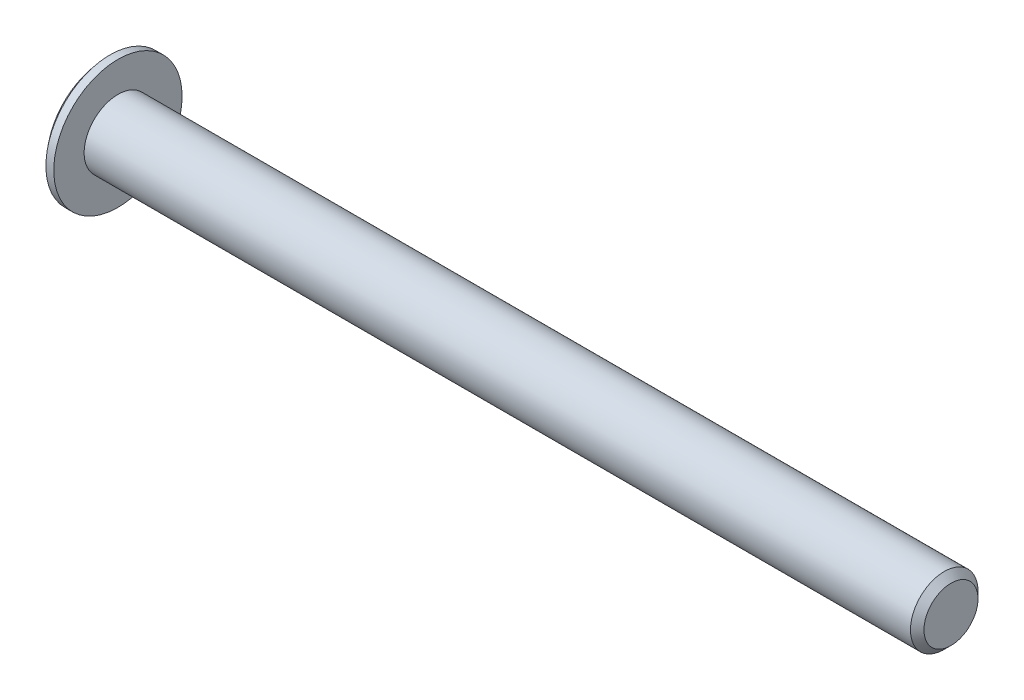
ISO-10303-21;
HEADER;
FILE_DESCRIPTION(('STEP AP214'),'2;1');
FILE_NAME('part.step','',(''),(''),'','','');
FILE_SCHEMA(('AUTOMOTIVE_DESIGN { 1 0 10303 214 1 1 1 1 }'));
ENDSEC;
DATA;
#1=APPLICATION_CONTEXT('core data for automotive mechanical design processes');
#2=APPLICATION_PROTOCOL_DEFINITION('international standard','automotive_design',2000,#1);
#3=PRODUCT_CONTEXT('',#1,'mechanical');
#4=PRODUCT('Part','Part','',(#3));
#5=PRODUCT_RELATED_PRODUCT_CATEGORY('part','',(#4));
#6=PRODUCT_DEFINITION_FORMATION('','',#4);
#7=PRODUCT_DEFINITION_CONTEXT('part definition',#1,'design');
#8=PRODUCT_DEFINITION('design','',#6,#7);
#9=PRODUCT_DEFINITION_SHAPE('','',#8);
#10=(LENGTH_UNIT() NAMED_UNIT(*) SI_UNIT(.MILLI.,.METRE.));
#11=(NAMED_UNIT(*) PLANE_ANGLE_UNIT() SI_UNIT($,.RADIAN.));
#12=(NAMED_UNIT(*) SI_UNIT($,.STERADIAN.) SOLID_ANGLE_UNIT());
#13=UNCERTAINTY_MEASURE_WITH_UNIT(LENGTH_MEASURE(1.E-05),#10,'distance_accuracy_value','');
#14=(GEOMETRIC_REPRESENTATION_CONTEXT(3) GLOBAL_UNCERTAINTY_ASSIGNED_CONTEXT((#13)) GLOBAL_UNIT_ASSIGNED_CONTEXT((#10,
#11,#12)) REPRESENTATION_CONTEXT('',''));
#15=CARTESIAN_POINT('',(0.,0.,0.));
#16=DIRECTION('',(0.,0.,1.));
#17=DIRECTION('',(1.,0.,0.));
#18=AXIS2_PLACEMENT_3D('',#15,#16,#17);
#19=CARTESIAN_POINT('',(0.,0.,0.));
#20=DIRECTION('',(1.,0.,0.));
#21=DIRECTION('',(0.,0.,1.));
#22=AXIS2_PLACEMENT_3D('',#19,#20,#21);
#23=PLANE('',#22);
#24=DIRECTION('',(0.,-0.5,0.866025403784439));
#25=VECTOR('',#24,1.);
#26=CARTESIAN_POINT('',(0.,2.3094010767585,0.));
#27=LINE('',#26,#25);
#28=CARTESIAN_POINT('',(0.,2.3094010767585,0.));
#29=VERTEX_POINT('',#28);
#30=CARTESIAN_POINT('',(0.,1.15470053837925,2.));
#31=VERTEX_POINT('',#30);
#32=EDGE_CURVE('E174',#29,#31,#27,.T.);
#33=ORIENTED_EDGE('',*,*,#32,.T.);
#34=DIRECTION('',(0.,-1.,0.));
#35=VECTOR('',#34,1.);
#36=CARTESIAN_POINT('',(0.,1.15470053837925,2.));
#37=LINE('',#36,#35);
#38=CARTESIAN_POINT('',(0.,-1.15470053837925,2.));
#39=VERTEX_POINT('',#38);
#40=EDGE_CURVE('E181',#31,#39,#37,.T.);
#41=ORIENTED_EDGE('',*,*,#40,.T.);
#42=DIRECTION('',(0.,-0.5,-0.866025403784439));
#43=VECTOR('',#42,1.);
#44=CARTESIAN_POINT('',(0.,-1.15470053837925,2.));
#45=LINE('',#44,#43);
#46=CARTESIAN_POINT('',(0.,-2.3094010767585,0.));
#47=VERTEX_POINT('',#46);
#48=EDGE_CURVE('E186',#39,#47,#45,.T.);
#49=ORIENTED_EDGE('',*,*,#48,.T.);
#50=DIRECTION('',(0.,0.5,-0.866025403784439));
#51=VECTOR('',#50,1.);
#52=CARTESIAN_POINT('',(0.,-2.3094010767585,0.));
#53=LINE('',#52,#51);
#54=CARTESIAN_POINT('',(0.,-1.15470053837925,-2.));
#55=VERTEX_POINT('',#54);
#56=EDGE_CURVE('E119',#47,#55,#53,.T.);
#57=ORIENTED_EDGE('',*,*,#56,.T.);
#58=DIRECTION('',(0.,1.,0.));
#59=VECTOR('',#58,1.);
#60=CARTESIAN_POINT('',(0.,-1.15470053837925,-2.));
#61=LINE('',#60,#59);
#62=CARTESIAN_POINT('',(0.,1.15470053837925,-2.));
#63=VERTEX_POINT('',#62);
#64=EDGE_CURVE('E193',#55,#63,#61,.T.);
#65=ORIENTED_EDGE('',*,*,#64,.T.);
#66=DIRECTION('',(0.,0.5,0.866025403784438));
#67=VECTOR('',#66,1.);
#68=CARTESIAN_POINT('',(0.,1.15470053837925,-2.));
#69=LINE('',#68,#67);
#70=EDGE_CURVE('E183',#63,#29,#69,.T.);
#71=ORIENTED_EDGE('',*,*,#70,.T.);
#72=EDGE_LOOP('',(#33,#41,#49,#57,#65,#71));
#73=FACE_BOUND('',#72,.T.);
#74=CARTESIAN_POINT('',(0.,0.,0.));
#75=DIRECTION('',(1.,0.,0.));
#76=DIRECTION('',(0.,0.,-1.));
#77=AXIS2_PLACEMENT_3D('',#74,#75,#76);
#78=CIRCLE('',#77,2.86);
#79=CARTESIAN_POINT('',(0.,0.,-2.86));
#80=VERTEX_POINT('',#79);
#81=EDGE_CURVE('E139',#80,#80,#78,.T.);
#82=ORIENTED_EDGE('',*,*,#81,.F.);
#83=EDGE_LOOP('',(#82));
#84=FACE_BOUND('',#83,.T.);
#85=ADVANCED_FACE('F41',(#73,#84),#23,.F.);
#86=CARTESIAN_POINT('',(6.73111701230913,0.,0.));
#87=DIRECTION('',(-1.,0.,0.));
#88=DIRECTION('',(0.,0.,-1.));
#89=AXIS2_PLACEMENT_3D('',#86,#87,#88);
#90=DEGENERATE_TOROIDAL_SURFACE('',#89,0.938525626868098,7.,.T.);
#91=ORIENTED_EDGE('',*,*,#81,.T.);
#92=EDGE_LOOP('',(#91));
#93=FACE_BOUND('',#92,.T.);
#94=CARTESIAN_POINT('',(1.6,0.,0.));
#95=DIRECTION('',(1.,0.,0.));
#96=DIRECTION('',(0.,0.,-1.));
#97=AXIS2_PLACEMENT_3D('',#94,#95,#96);
#98=CIRCLE('',#97,5.7);
#99=CARTESIAN_POINT('',(1.6,0.,-5.7));
#100=VERTEX_POINT('',#99);
#101=EDGE_CURVE('E136',#100,#100,#98,.T.);
#102=ORIENTED_EDGE('',*,*,#101,.F.);
#103=EDGE_LOOP('',(#102));
#104=FACE_BOUND('',#103,.T.);
#105=ADVANCED_FACE('F160',(#93,#104),#90,.T.);
#106=CARTESIAN_POINT('',(0.,0.,0.));
#107=DIRECTION('',(-1.,0.,0.));
#108=DIRECTION('',(0.,0.,-1.));
#109=AXIS2_PLACEMENT_3D('',#106,#107,#108);
#110=CYLINDRICAL_SURFACE('',#109,5.7);
#111=ORIENTED_EDGE('',*,*,#101,.T.);
#112=EDGE_LOOP('',(#111));
#113=FACE_BOUND('',#112,.T.);
#114=CARTESIAN_POINT('',(2.3,0.,0.));
#115=DIRECTION('',(1.,0.,0.));
#116=DIRECTION('',(0.,0.,-1.));
#117=AXIS2_PLACEMENT_3D('',#114,#115,#116);
#118=CIRCLE('',#117,5.7);
#119=CARTESIAN_POINT('',(2.3,0.,-5.7));
#120=VERTEX_POINT('',#119);
#121=EDGE_CURVE('E133',#120,#120,#118,.T.);
#122=ORIENTED_EDGE('',*,*,#121,.F.);
#123=EDGE_LOOP('',(#122));
#124=FACE_BOUND('',#123,.T.);
#125=ADVANCED_FACE('F154',(#113,#124),#110,.T.);
#126=CARTESIAN_POINT('',(2.3,5.7,0.));
#127=DIRECTION('',(-1.,0.,0.));
#128=DIRECTION('',(0.,0.,-1.));
#129=AXIS2_PLACEMENT_3D('',#126,#127,#128);
#130=PLANE('',#129);
#131=ORIENTED_EDGE('',*,*,#121,.T.);
#132=EDGE_LOOP('',(#131));
#133=FACE_BOUND('',#132,.T.);
#134=CARTESIAN_POINT('',(2.3,0.,0.));
#135=DIRECTION('',(1.,0.,0.));
#136=DIRECTION('',(0.,0.,-1.));
#137=AXIS2_PLACEMENT_3D('',#134,#135,#136);
#138=CIRCLE('',#137,3.);
#139=CARTESIAN_POINT('',(2.3,0.,-3.));
#140=VERTEX_POINT('',#139);
#141=EDGE_CURVE('E130',#140,#140,#138,.T.);
#142=ORIENTED_EDGE('',*,*,#141,.F.);
#143=EDGE_LOOP('',(#142));
#144=FACE_BOUND('',#143,.T.);
#145=ADVANCED_FACE('F149',(#133,#144),#130,.F.);
#146=CARTESIAN_POINT('',(0.,0.,0.));
#147=DIRECTION('',(-1.,0.,0.));
#148=DIRECTION('',(0.,0.,-1.));
#149=AXIS2_PLACEMENT_3D('',#146,#147,#148);
#150=CYLINDRICAL_SURFACE('',#149,3.);
#151=CARTESIAN_POINT('',(75.7,0.,0.));
#152=DIRECTION('',(1.,0.,0.));
#153=DIRECTION('',(0.,0.,-1.));
#154=AXIS2_PLACEMENT_3D('',#151,#152,#153);
#155=CIRCLE('',#154,3.);
#156=CARTESIAN_POINT('',(75.7,0.,-3.));
#157=VERTEX_POINT('',#156);
#158=EDGE_CURVE('E49',#157,#157,#155,.T.);
#159=ORIENTED_EDGE('',*,*,#158,.F.);
#160=EDGE_LOOP('',(#159));
#161=FACE_BOUND('',#160,.T.);
#162=ORIENTED_EDGE('',*,*,#141,.T.);
#163=EDGE_LOOP('',(#162));
#164=FACE_BOUND('',#163,.T.);
#165=ADVANCED_FACE('F145',(#161,#164),#150,.T.);
#166=CARTESIAN_POINT('',(76.3,3.,0.));
#167=DIRECTION('',(-1.,0.,0.));
#168=DIRECTION('',(0.,0.,-1.));
#169=AXIS2_PLACEMENT_3D('',#166,#167,#168);
#170=PLANE('',#169);
#171=CARTESIAN_POINT('',(76.3,0.,0.));
#172=DIRECTION('',(1.,0.,0.));
#173=DIRECTION('',(0.,0.,-1.));
#174=AXIS2_PLACEMENT_3D('',#171,#172,#173);
#175=CIRCLE('',#174,2.4);
#176=CARTESIAN_POINT('',(76.3,0.,-2.4));
#177=VERTEX_POINT('',#176);
#178=EDGE_CURVE('E11',#177,#177,#175,.F.);
#179=ORIENTED_EDGE('',*,*,#178,.F.);
#180=EDGE_LOOP('',(#179));
#181=FACE_BOUND('',#180,.T.);
#182=ADVANCED_FACE('F148',(#181),#170,.F.);
#183=CARTESIAN_POINT('',(75.7,0.,0.));
#184=DIRECTION('',(-1.,0.,0.));
#185=DIRECTION('',(0.,0.,-1.));
#186=AXIS2_PLACEMENT_3D('',#183,#184,#185);
#187=CONICAL_SURFACE('',#186,3.,0.785398163397435);
#188=ORIENTED_EDGE('',*,*,#178,.T.);
#189=EDGE_LOOP('',(#188));
#190=FACE_BOUND('',#189,.T.);
#191=ORIENTED_EDGE('',*,*,#158,.T.);
#192=EDGE_LOOP('',(#191));
#193=FACE_BOUND('',#192,.T.);
#194=ADVANCED_FACE('F43',(#190,#193),#187,.T.);
#195=CARTESIAN_POINT('',(2.,1.15470053837925,-2.));
#196=DIRECTION('',(0.,0.866025403784438,-0.5));
#197=DIRECTION('',(0.,-0.5,-0.866025403784439));
#198=AXIS2_PLACEMENT_3D('',#195,#196,#197);
#199=PLANE('',#198);
#200=ORIENTED_EDGE('',*,*,#70,.F.);
#201=DIRECTION('',(-1.,0.,0.));
#202=VECTOR('',#201,1.);
#203=CARTESIAN_POINT('',(2.,1.15470053837925,-2.));
#204=LINE('',#203,#202);
#205=CARTESIAN_POINT('',(2.,1.15470053837925,-2.));
#206=VERTEX_POINT('',#205);
#207=EDGE_CURVE('E87',#206,#63,#204,.T.);
#208=ORIENTED_EDGE('',*,*,#207,.F.);
#209=DIRECTION('',(0.,0.5,0.866025403784438));
#210=VECTOR('',#209,1.);
#211=CARTESIAN_POINT('',(2.,1.15470053837925,-2.));
#212=LINE('',#211,#210);
#213=CARTESIAN_POINT('',(2.,2.3094010767585,0.));
#214=VERTEX_POINT('',#213);
#215=EDGE_CURVE('E194',#206,#214,#212,.T.);
#216=ORIENTED_EDGE('',*,*,#215,.T.);
#217=DIRECTION('',(-1.,0.,0.));
#218=VECTOR('',#217,1.);
#219=CARTESIAN_POINT('',(2.,2.3094010767585,0.));
#220=LINE('',#219,#218);
#221=EDGE_CURVE('E56',#214,#29,#220,.T.);
#222=ORIENTED_EDGE('',*,*,#221,.T.);
#223=EDGE_LOOP('',(#200,#208,#216,#222));
#224=FACE_BOUND('',#223,.T.);
#225=ADVANCED_FACE('F212',(#224),#199,.F.);
#226=CARTESIAN_POINT('',(2.,-1.15470053837925,-2.));
#227=DIRECTION('',(0.,0.,-1.));
#228=DIRECTION('',(1.,0.,0.));
#229=AXIS2_PLACEMENT_3D('',#226,#227,#228);
#230=PLANE('',#229);
#231=ORIENTED_EDGE('',*,*,#64,.F.);
#232=DIRECTION('',(-1.,0.,0.));
#233=VECTOR('',#232,1.);
#234=CARTESIAN_POINT('',(2.,-1.15470053837925,-2.));
#235=LINE('',#234,#233);
#236=CARTESIAN_POINT('',(2.,-1.15470053837925,-2.));
#237=VERTEX_POINT('',#236);
#238=EDGE_CURVE('E121',#237,#55,#235,.T.);
#239=ORIENTED_EDGE('',*,*,#238,.F.);
#240=DIRECTION('',(0.,1.,0.));
#241=VECTOR('',#240,1.);
#242=CARTESIAN_POINT('',(2.,-1.15470053837925,-2.));
#243=LINE('',#242,#241);
#244=EDGE_CURVE('E65',#237,#206,#243,.T.);
#245=ORIENTED_EDGE('',*,*,#244,.T.);
#246=ORIENTED_EDGE('',*,*,#207,.T.);
#247=EDGE_LOOP('',(#231,#239,#245,#246));
#248=FACE_BOUND('',#247,.T.);
#249=ADVANCED_FACE('F215',(#248),#230,.F.);
#250=CARTESIAN_POINT('',(2.,-2.3094010767585,0.));
#251=DIRECTION('',(0.,-0.866025403784439,-0.5));
#252=DIRECTION('',(0.,-0.5,0.866025403784439));
#253=AXIS2_PLACEMENT_3D('',#250,#251,#252);
#254=PLANE('',#253);
#255=ORIENTED_EDGE('',*,*,#56,.F.);
#256=DIRECTION('',(-1.,0.,0.));
#257=VECTOR('',#256,1.);
#258=CARTESIAN_POINT('',(2.,-2.3094010767585,0.));
#259=LINE('',#258,#257);
#260=CARTESIAN_POINT('',(2.,-2.3094010767585,0.));
#261=VERTEX_POINT('',#260);
#262=EDGE_CURVE('E108',#261,#47,#259,.T.);
#263=ORIENTED_EDGE('',*,*,#262,.F.);
#264=DIRECTION('',(0.,0.5,-0.866025403784439));
#265=VECTOR('',#264,1.);
#266=CARTESIAN_POINT('',(2.,-2.3094010767585,0.));
#267=LINE('',#266,#265);
#268=EDGE_CURVE('E111',#261,#237,#267,.T.);
#269=ORIENTED_EDGE('',*,*,#268,.T.);
#270=ORIENTED_EDGE('',*,*,#238,.T.);
#271=EDGE_LOOP('',(#255,#263,#269,#270));
#272=FACE_BOUND('',#271,.T.);
#273=ADVANCED_FACE('F117',(#272),#254,.F.);
#274=CARTESIAN_POINT('',(2.,-1.15470053837925,2.));
#275=DIRECTION('',(0.,-0.866025403784439,0.5));
#276=DIRECTION('',(0.,0.5,0.866025403784439));
#277=AXIS2_PLACEMENT_3D('',#274,#275,#276);
#278=PLANE('',#277);
#279=ORIENTED_EDGE('',*,*,#48,.F.);
#280=DIRECTION('',(-1.,0.,0.));
#281=VECTOR('',#280,1.);
#282=CARTESIAN_POINT('',(2.,-1.15470053837925,2.));
#283=LINE('',#282,#281);
#284=CARTESIAN_POINT('',(2.,-1.15470053837925,2.));
#285=VERTEX_POINT('',#284);
#286=EDGE_CURVE('E110',#285,#39,#283,.T.);
#287=ORIENTED_EDGE('',*,*,#286,.F.);
#288=DIRECTION('',(0.,-0.5,-0.866025403784439));
#289=VECTOR('',#288,1.);
#290=CARTESIAN_POINT('',(2.,-1.15470053837925,2.));
#291=LINE('',#290,#289);
#292=EDGE_CURVE('E103',#285,#261,#291,.T.);
#293=ORIENTED_EDGE('',*,*,#292,.T.);
#294=ORIENTED_EDGE('',*,*,#262,.T.);
#295=EDGE_LOOP('',(#279,#287,#293,#294));
#296=FACE_BOUND('',#295,.T.);
#297=ADVANCED_FACE('F106',(#296),#278,.F.);
#298=CARTESIAN_POINT('',(2.,1.15470053837925,2.));
#299=DIRECTION('',(0.,0.,1.));
#300=DIRECTION('',(0.,1.,0.));
#301=AXIS2_PLACEMENT_3D('',#298,#299,#300);
#302=PLANE('',#301);
#303=ORIENTED_EDGE('',*,*,#40,.F.);
#304=DIRECTION('',(-1.,0.,0.));
#305=VECTOR('',#304,1.);
#306=CARTESIAN_POINT('',(2.,1.15470053837925,2.));
#307=LINE('',#306,#305);
#308=CARTESIAN_POINT('',(2.,1.15470053837925,2.));
#309=VERTEX_POINT('',#308);
#310=EDGE_CURVE('E124',#309,#31,#307,.T.);
#311=ORIENTED_EDGE('',*,*,#310,.F.);
#312=DIRECTION('',(0.,-1.,0.));
#313=VECTOR('',#312,1.);
#314=CARTESIAN_POINT('',(2.,1.15470053837925,2.));
#315=LINE('',#314,#313);
#316=EDGE_CURVE('E112',#309,#285,#315,.T.);
#317=ORIENTED_EDGE('',*,*,#316,.T.);
#318=ORIENTED_EDGE('',*,*,#286,.T.);
#319=EDGE_LOOP('',(#303,#311,#317,#318));
#320=FACE_BOUND('',#319,.T.);
#321=ADVANCED_FACE('F200',(#320),#302,.F.);
#322=CARTESIAN_POINT('',(2.,2.3094010767585,0.));
#323=DIRECTION('',(0.,0.866025403784439,0.5));
#324=DIRECTION('',(0.,0.5,-0.866025403784439));
#325=AXIS2_PLACEMENT_3D('',#322,#323,#324);
#326=PLANE('',#325);
#327=ORIENTED_EDGE('',*,*,#32,.F.);
#328=ORIENTED_EDGE('',*,*,#221,.F.);
#329=DIRECTION('',(0.,-0.5,0.866025403784439));
#330=VECTOR('',#329,1.);
#331=CARTESIAN_POINT('',(2.,2.3094010767585,0.));
#332=LINE('',#331,#330);
#333=EDGE_CURVE('E94',#214,#309,#332,.T.);
#334=ORIENTED_EDGE('',*,*,#333,.T.);
#335=ORIENTED_EDGE('',*,*,#310,.T.);
#336=EDGE_LOOP('',(#327,#328,#334,#335));
#337=FACE_BOUND('',#336,.T.);
#338=ADVANCED_FACE('F201',(#337),#326,.F.);
#339=CARTESIAN_POINT('',(2.,0.,0.));
#340=DIRECTION('',(-1.,0.,0.));
#341=DIRECTION('',(0.,0.,-1.));
#342=AXIS2_PLACEMENT_3D('',#339,#340,#341);
#343=PLANE('',#342);
#344=ORIENTED_EDGE('',*,*,#215,.F.);
#345=ORIENTED_EDGE('',*,*,#244,.F.);
#346=ORIENTED_EDGE('',*,*,#268,.F.);
#347=ORIENTED_EDGE('',*,*,#292,.F.);
#348=ORIENTED_EDGE('',*,*,#316,.F.);
#349=ORIENTED_EDGE('',*,*,#333,.F.);
#350=EDGE_LOOP('',(#344,#345,#346,#347,#348,#349));
#351=FACE_BOUND('',#350,.T.);
#352=ADVANCED_FACE('F114',(#351),#343,.T.);
#353=CLOSED_SHELL('',(#85,#105,#125,#145,#165,#182,#194,#225,#249,#273,#297,#321,#338,#352));
#354=MANIFOLD_SOLID_BREP('B2',#353);
#355=ADVANCED_BREP_SHAPE_REPRESENTATION('',(#18,#354),#14);
#356=SHAPE_DEFINITION_REPRESENTATION(#9,#355);
ENDSEC;
END-ISO-10303-21;
